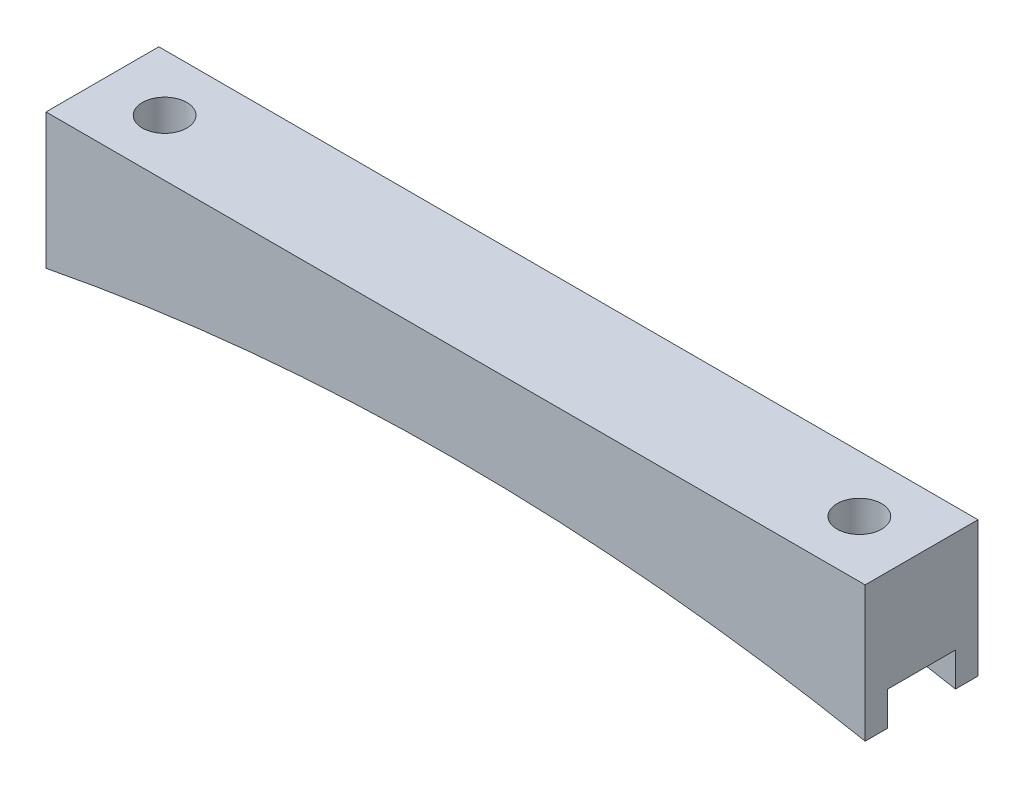
ISO-10303-21;
HEADER;
FILE_DESCRIPTION(('STEP AP214'),'2;1');
FILE_NAME('part.step','',(''),(''),'','','');
FILE_SCHEMA(('AUTOMOTIVE_DESIGN { 1 0 10303 214 1 1 1 1 }'));
ENDSEC;
DATA;
#1=APPLICATION_CONTEXT('core data for automotive mechanical design processes');
#2=APPLICATION_PROTOCOL_DEFINITION('international standard','automotive_design',2000,#1);
#3=PRODUCT_CONTEXT('',#1,'mechanical');
#4=PRODUCT('Part','Part','',(#3));
#5=PRODUCT_RELATED_PRODUCT_CATEGORY('part','',(#4));
#6=PRODUCT_DEFINITION_FORMATION('','',#4);
#7=PRODUCT_DEFINITION_CONTEXT('part definition',#1,'design');
#8=PRODUCT_DEFINITION('design','',#6,#7);
#9=PRODUCT_DEFINITION_SHAPE('','',#8);
#10=(LENGTH_UNIT() NAMED_UNIT(*) SI_UNIT(.MILLI.,.METRE.));
#11=(NAMED_UNIT(*) PLANE_ANGLE_UNIT() SI_UNIT($,.RADIAN.));
#12=(NAMED_UNIT(*) SI_UNIT($,.STERADIAN.) SOLID_ANGLE_UNIT());
#13=UNCERTAINTY_MEASURE_WITH_UNIT(LENGTH_MEASURE(1.E-05),#10,'distance_accuracy_value','');
#14=(GEOMETRIC_REPRESENTATION_CONTEXT(3) GLOBAL_UNCERTAINTY_ASSIGNED_CONTEXT((#13)) GLOBAL_UNIT_ASSIGNED_CONTEXT((#10,
#11,#12)) REPRESENTATION_CONTEXT('',''));
#15=CARTESIAN_POINT('',(0.,0.,0.));
#16=DIRECTION('',(0.,0.,1.));
#17=DIRECTION('',(1.,0.,0.));
#18=AXIS2_PLACEMENT_3D('',#15,#16,#17);
#19=CARTESIAN_POINT('',(46.095,0.,12.7));
#20=DIRECTION('',(-1.,0.,0.));
#21=DIRECTION('',(0.,0.,1.));
#22=AXIS2_PLACEMENT_3D('',#19,#20,#21);
#23=PLANE('',#22);
#24=DIRECTION('',(0.,0.,-1.));
#25=VECTOR('',#24,1.);
#26=CARTESIAN_POINT('',(46.095,-15.24,12.7));
#27=LINE('',#26,#25);
#28=CARTESIAN_POINT('',(46.095,-15.24,12.7));
#29=VERTEX_POINT('',#28);
#30=CARTESIAN_POINT('',(46.095,-15.24,10.16));
#31=VERTEX_POINT('',#30);
#32=EDGE_CURVE('E156',#29,#31,#27,.T.);
#33=ORIENTED_EDGE('',*,*,#32,.T.);
#34=DIRECTION('',(0.,-1.,0.));
#35=VECTOR('',#34,1.);
#36=CARTESIAN_POINT('',(46.095,-15.24,10.16));
#37=LINE('',#36,#35);
#38=CARTESIAN_POINT('',(46.095,-11.43,10.16));
#39=VERTEX_POINT('',#38);
#40=EDGE_CURVE('E185',#39,#31,#37,.T.);
#41=ORIENTED_EDGE('',*,*,#40,.F.);
#42=DIRECTION('',(0.,0.,1.));
#43=VECTOR('',#42,1.);
#44=CARTESIAN_POINT('',(46.095,-11.43,10.16));
#45=LINE('',#44,#43);
#46=CARTESIAN_POINT('',(46.095,-11.43,2.54));
#47=VERTEX_POINT('',#46);
#48=EDGE_CURVE('E141',#47,#39,#45,.T.);
#49=ORIENTED_EDGE('',*,*,#48,.F.);
#50=DIRECTION('',(0.,1.,0.));
#51=VECTOR('',#50,1.);
#52=CARTESIAN_POINT('',(46.095,-15.24,2.54));
#53=LINE('',#52,#51);
#54=CARTESIAN_POINT('',(46.095,-15.24,2.54));
#55=VERTEX_POINT('',#54);
#56=EDGE_CURVE('E177',#55,#47,#53,.T.);
#57=ORIENTED_EDGE('',*,*,#56,.F.);
#58=CARTESIAN_POINT('',(46.095,-15.24,0.));
#59=VERTEX_POINT('',#58);
#60=EDGE_CURVE('E174',#55,#59,#27,.T.);
#61=ORIENTED_EDGE('',*,*,#60,.T.);
#62=DIRECTION('',(0.,1.,0.));
#63=VECTOR('',#62,1.);
#64=CARTESIAN_POINT('',(46.095,0.,0.));
#65=LINE('',#64,#63);
#66=CARTESIAN_POINT('',(46.095,0.,0.));
#67=VERTEX_POINT('',#66);
#68=EDGE_CURVE('E213',#59,#67,#65,.T.);
#69=ORIENTED_EDGE('',*,*,#68,.T.);
#70=DIRECTION('',(0.,0.,-1.));
#71=VECTOR('',#70,1.);
#72=CARTESIAN_POINT('',(46.095,0.,12.7));
#73=LINE('',#72,#71);
#74=CARTESIAN_POINT('',(46.095,0.,12.7));
#75=VERTEX_POINT('',#74);
#76=EDGE_CURVE('E154',#75,#67,#73,.T.);
#77=ORIENTED_EDGE('',*,*,#76,.F.);
#78=DIRECTION('',(0.,1.,0.));
#79=VECTOR('',#78,1.);
#80=CARTESIAN_POINT('',(46.095,0.,12.7));
#81=LINE('',#80,#79);
#82=EDGE_CURVE('E217',#29,#75,#81,.T.);
#83=ORIENTED_EDGE('',*,*,#82,.F.);
#84=EDGE_LOOP('',(#33,#41,#49,#57,#61,#69,#77,#83));
#85=FACE_BOUND('',#84,.T.);
#86=ADVANCED_FACE('F43',(#85),#23,.F.);
#87=CARTESIAN_POINT('',(-46.095,0.,12.7));
#88=DIRECTION('',(0.,-1.,0.));
#89=DIRECTION('',(1.,0.,0.));
#90=AXIS2_PLACEMENT_3D('',#87,#88,#89);
#91=PLANE('',#90);
#92=CARTESIAN_POINT('',(-39.095,0.,6.35));
#93=DIRECTION('',(0.,1.,0.));
#94=DIRECTION('',(-1.,0.,0.));
#95=AXIS2_PLACEMENT_3D('',#92,#93,#94);
#96=CIRCLE('',#95,2.49999999999999);
#97=CARTESIAN_POINT('',(-41.595,0.,6.35));
#98=VERTEX_POINT('',#97);
#99=EDGE_CURVE('E209',#98,#98,#96,.T.);
#100=ORIENTED_EDGE('',*,*,#99,.F.);
#101=EDGE_LOOP('',(#100));
#102=FACE_BOUND('',#101,.T.);
#103=CARTESIAN_POINT('',(39.095,0.,6.35));
#104=DIRECTION('',(0.,1.,0.));
#105=DIRECTION('',(-1.,0.,0.));
#106=AXIS2_PLACEMENT_3D('',#103,#104,#105);
#107=CIRCLE('',#106,2.5);
#108=CARTESIAN_POINT('',(36.595,0.,6.35));
#109=VERTEX_POINT('',#108);
#110=EDGE_CURVE('E208',#109,#109,#107,.T.);
#111=ORIENTED_EDGE('',*,*,#110,.F.);
#112=EDGE_LOOP('',(#111));
#113=FACE_BOUND('',#112,.T.);
#114=DIRECTION('',(-1.,0.,0.));
#115=VECTOR('',#114,1.);
#116=CARTESIAN_POINT('',(-46.095,0.,0.));
#117=LINE('',#116,#115);
#118=CARTESIAN_POINT('',(-46.095,0.,0.));
#119=VERTEX_POINT('',#118);
#120=EDGE_CURVE('E232',#67,#119,#117,.T.);
#121=ORIENTED_EDGE('',*,*,#120,.T.);
#122=DIRECTION('',(0.,0.,-1.));
#123=VECTOR('',#122,1.);
#124=CARTESIAN_POINT('',(-46.095,0.,12.7));
#125=LINE('',#124,#123);
#126=CARTESIAN_POINT('',(-46.095,0.,12.7));
#127=VERTEX_POINT('',#126);
#128=EDGE_CURVE('E148',#127,#119,#125,.T.);
#129=ORIENTED_EDGE('',*,*,#128,.F.);
#130=DIRECTION('',(-1.,0.,0.));
#131=VECTOR('',#130,1.);
#132=CARTESIAN_POINT('',(-46.095,0.,12.7));
#133=LINE('',#132,#131);
#134=EDGE_CURVE('E221',#75,#127,#133,.T.);
#135=ORIENTED_EDGE('',*,*,#134,.F.);
#136=ORIENTED_EDGE('',*,*,#76,.T.);
#137=EDGE_LOOP('',(#121,#129,#135,#136));
#138=FACE_BOUND('',#137,.T.);
#139=ADVANCED_FACE('F247',(#102,#113,#138),#91,.F.);
#140=CARTESIAN_POINT('',(-46.095,0.,12.7));
#141=DIRECTION('',(1.,0.,0.));
#142=DIRECTION('',(0.,0.,-1.));
#143=AXIS2_PLACEMENT_3D('',#140,#141,#142);
#144=PLANE('',#143);
#145=DIRECTION('',(0.,0.,1.));
#146=VECTOR('',#145,1.);
#147=CARTESIAN_POINT('',(-46.095,-11.43,10.16));
#148=LINE('',#147,#146);
#149=CARTESIAN_POINT('',(-46.095,-11.43,2.54));
#150=VERTEX_POINT('',#149);
#151=CARTESIAN_POINT('',(-46.095,-11.43,10.16));
#152=VERTEX_POINT('',#151);
#153=EDGE_CURVE('E139',#150,#152,#148,.T.);
#154=ORIENTED_EDGE('',*,*,#153,.T.);
#155=DIRECTION('',(0.,-1.,0.));
#156=VECTOR('',#155,1.);
#157=CARTESIAN_POINT('',(-46.095,-15.24,10.16));
#158=LINE('',#157,#156);
#159=CARTESIAN_POINT('',(-46.095,-15.24,10.16));
#160=VERTEX_POINT('',#159);
#161=EDGE_CURVE('E124',#152,#160,#158,.T.);
#162=ORIENTED_EDGE('',*,*,#161,.T.);
#163=DIRECTION('',(0.,0.,-1.));
#164=VECTOR('',#163,1.);
#165=CARTESIAN_POINT('',(-46.095,-15.24,12.7));
#166=LINE('',#165,#164);
#167=CARTESIAN_POINT('',(-46.095,-15.24,12.7));
#168=VERTEX_POINT('',#167);
#169=EDGE_CURVE('E136',#168,#160,#166,.T.);
#170=ORIENTED_EDGE('',*,*,#169,.F.);
#171=DIRECTION('',(0.,-1.,0.));
#172=VECTOR('',#171,1.);
#173=CARTESIAN_POINT('',(-46.095,0.,12.7));
#174=LINE('',#173,#172);
#175=EDGE_CURVE('E225',#127,#168,#174,.T.);
#176=ORIENTED_EDGE('',*,*,#175,.F.);
#177=ORIENTED_EDGE('',*,*,#128,.T.);
#178=DIRECTION('',(0.,-1.,0.));
#179=VECTOR('',#178,1.);
#180=CARTESIAN_POINT('',(-46.095,0.,0.));
#181=LINE('',#180,#179);
#182=CARTESIAN_POINT('',(-46.095,-15.24,0.));
#183=VERTEX_POINT('',#182);
#184=EDGE_CURVE('E235',#119,#183,#181,.T.);
#185=ORIENTED_EDGE('',*,*,#184,.T.);
#186=CARTESIAN_POINT('',(-46.095,-15.24,2.54));
#187=VERTEX_POINT('',#186);
#188=EDGE_CURVE('E149',#187,#183,#166,.T.);
#189=ORIENTED_EDGE('',*,*,#188,.F.);
#190=DIRECTION('',(0.,1.,0.));
#191=VECTOR('',#190,1.);
#192=CARTESIAN_POINT('',(-46.095,-15.24,2.54));
#193=LINE('',#192,#191);
#194=EDGE_CURVE('E67',#187,#150,#193,.T.);
#195=ORIENTED_EDGE('',*,*,#194,.T.);
#196=EDGE_LOOP('',(#154,#162,#170,#176,#177,#185,#189,#195));
#197=FACE_BOUND('',#196,.T.);
#198=ADVANCED_FACE('F134',(#197),#144,.F.);
#199=CARTESIAN_POINT('',(0.,-252.096372037993,12.7));
#200=DIRECTION('',(0.,0.,-1.));
#201=DIRECTION('',(-1.,0.,0.));
#202=AXIS2_PLACEMENT_3D('',#199,#200,#201);
#203=CYLINDRICAL_SURFACE('',#202,241.3);
#204=DIRECTION('',(0.,0.,-1.));
#205=VECTOR('',#204,1.);
#206=CARTESIAN_POINT('',(17.4753360502879,-11.43,12.7));
#207=LINE('',#206,#205);
#208=CARTESIAN_POINT('',(17.4753360502879,-11.43,2.54));
#209=VERTEX_POINT('',#208);
#210=CARTESIAN_POINT('',(17.4753360502879,-11.43,10.16));
#211=VERTEX_POINT('',#210);
#212=EDGE_CURVE('E172',#209,#211,#207,.F.);
#213=ORIENTED_EDGE('',*,*,#212,.T.);
#214=CARTESIAN_POINT('',(0.,-252.096372037993,10.16));
#215=DIRECTION('',(0.,0.,1.));
#216=DIRECTION('',(1.,0.,0.));
#217=AXIS2_PLACEMENT_3D('',#214,#215,#216);
#218=CIRCLE('',#217,241.3);
#219=EDGE_CURVE('E11',#211,#31,#218,.F.);
#220=ORIENTED_EDGE('',*,*,#219,.T.);
#221=ORIENTED_EDGE('',*,*,#32,.F.);
#222=CARTESIAN_POINT('',(0.,-252.096372037993,12.7));
#223=DIRECTION('',(0.,0.,-1.));
#224=DIRECTION('',(-1.,0.,0.));
#225=AXIS2_PLACEMENT_3D('',#222,#223,#224);
#226=CIRCLE('',#225,241.3);
#227=EDGE_CURVE('E146',#168,#29,#226,.T.);
#228=ORIENTED_EDGE('',*,*,#227,.F.);
#229=ORIENTED_EDGE('',*,*,#169,.T.);
#230=CARTESIAN_POINT('',(-17.4753360502879,-11.43,10.16));
#231=VERTEX_POINT('',#230);
#232=EDGE_CURVE('E46',#160,#231,#218,.F.);
#233=ORIENTED_EDGE('',*,*,#232,.T.);
#234=DIRECTION('',(0.,0.,-1.));
#235=VECTOR('',#234,1.);
#236=CARTESIAN_POINT('',(-17.4753360502879,-11.43,12.7));
#237=LINE('',#236,#235);
#238=CARTESIAN_POINT('',(-17.4753360502879,-11.43,2.54));
#239=VERTEX_POINT('',#238);
#240=EDGE_CURVE('E203',#231,#239,#237,.T.);
#241=ORIENTED_EDGE('',*,*,#240,.T.);
#242=CARTESIAN_POINT('',(0.,-252.096372037993,2.54));
#243=DIRECTION('',(0.,0.,-1.));
#244=DIRECTION('',(-1.,0.,0.));
#245=AXIS2_PLACEMENT_3D('',#242,#243,#244);
#246=CIRCLE('',#245,241.3);
#247=EDGE_CURVE('E131',#239,#187,#246,.F.);
#248=ORIENTED_EDGE('',*,*,#247,.T.);
#249=ORIENTED_EDGE('',*,*,#188,.T.);
#250=CARTESIAN_POINT('',(0.,-252.096372037993,0.));
#251=DIRECTION('',(0.,0.,-1.));
#252=DIRECTION('',(-1.,0.,0.));
#253=AXIS2_PLACEMENT_3D('',#250,#251,#252);
#254=CIRCLE('',#253,241.3);
#255=EDGE_CURVE('E222',#183,#59,#254,.T.);
#256=ORIENTED_EDGE('',*,*,#255,.T.);
#257=ORIENTED_EDGE('',*,*,#60,.F.);
#258=EDGE_CURVE('E52',#55,#209,#246,.F.);
#259=ORIENTED_EDGE('',*,*,#258,.T.);
#260=EDGE_LOOP('',(#213,#220,#221,#228,#229,#233,#241,#248,#249,#256,#257,#259));
#261=FACE_BOUND('',#260,.T.);
#262=ADVANCED_FACE('F144',(#261),#203,.F.);
#263=CARTESIAN_POINT('',(0.,-252.096372037993,12.7));
#264=DIRECTION('',(0.,0.,-1.));
#265=DIRECTION('',(-1.,0.,0.));
#266=AXIS2_PLACEMENT_3D('',#263,#264,#265);
#267=PLANE('',#266);
#268=ORIENTED_EDGE('',*,*,#82,.T.);
#269=ORIENTED_EDGE('',*,*,#134,.T.);
#270=ORIENTED_EDGE('',*,*,#175,.T.);
#271=ORIENTED_EDGE('',*,*,#227,.T.);
#272=EDGE_LOOP('',(#268,#269,#270,#271));
#273=FACE_BOUND('',#272,.T.);
#274=ADVANCED_FACE('F250',(#273),#267,.F.);
#275=CARTESIAN_POINT('',(0.,-252.096372037993,0.));
#276=DIRECTION('',(0.,0.,-1.));
#277=DIRECTION('',(-1.,0.,0.));
#278=AXIS2_PLACEMENT_3D('',#275,#276,#277);
#279=PLANE('',#278);
#280=ORIENTED_EDGE('',*,*,#68,.F.);
#281=ORIENTED_EDGE('',*,*,#255,.F.);
#282=ORIENTED_EDGE('',*,*,#184,.F.);
#283=ORIENTED_EDGE('',*,*,#120,.F.);
#284=EDGE_LOOP('',(#280,#281,#282,#283));
#285=FACE_BOUND('',#284,.T.);
#286=ADVANCED_FACE('F243',(#285),#279,.T.);
#287=CARTESIAN_POINT('',(39.095,-15.24,6.35));
#288=DIRECTION('',(0.,1.,0.));
#289=DIRECTION('',(-1.,0.,0.));
#290=AXIS2_PLACEMENT_3D('',#287,#288,#289);
#291=CYLINDRICAL_SURFACE('',#290,2.5);
#292=CARTESIAN_POINT('',(39.095,-11.43,6.35));
#293=DIRECTION('',(0.,1.,0.));
#294=DIRECTION('',(0.,0.,1.));
#295=AXIS2_PLACEMENT_3D('',#292,#293,#294);
#296=CIRCLE('',#295,2.5);
#297=CARTESIAN_POINT('',(39.095,-11.43,8.85));
#298=VERTEX_POINT('',#297);
#299=EDGE_CURVE('E166',#298,#298,#296,.F.);
#300=ORIENTED_EDGE('',*,*,#299,.T.);
#301=EDGE_LOOP('',(#300));
#302=FACE_BOUND('',#301,.T.);
#303=ORIENTED_EDGE('',*,*,#110,.T.);
#304=EDGE_LOOP('',(#303));
#305=FACE_BOUND('',#304,.T.);
#306=ADVANCED_FACE('F292',(#302,#305),#291,.F.);
#307=CARTESIAN_POINT('',(-39.095,-15.24,6.35));
#308=DIRECTION('',(0.,1.,0.));
#309=DIRECTION('',(-1.,0.,0.));
#310=AXIS2_PLACEMENT_3D('',#307,#308,#309);
#311=CYLINDRICAL_SURFACE('',#310,2.49999999999999);
#312=CARTESIAN_POINT('',(-39.095,-11.43,6.35));
#313=DIRECTION('',(0.,1.,0.));
#314=DIRECTION('',(0.,0.,1.));
#315=AXIS2_PLACEMENT_3D('',#312,#313,#314);
#316=CIRCLE('',#315,2.49999999999999);
#317=CARTESIAN_POINT('',(-39.095,-11.43,8.84999999999999));
#318=VERTEX_POINT('',#317);
#319=EDGE_CURVE('E163',#318,#318,#316,.F.);
#320=ORIENTED_EDGE('',*,*,#319,.T.);
#321=EDGE_LOOP('',(#320));
#322=FACE_BOUND('',#321,.T.);
#323=ORIENTED_EDGE('',*,*,#99,.T.);
#324=EDGE_LOOP('',(#323));
#325=FACE_BOUND('',#324,.T.);
#326=ADVANCED_FACE('F274',(#322,#325),#311,.F.);
#327=CARTESIAN_POINT('',(-46.095,-11.43,10.16));
#328=DIRECTION('',(0.,1.,0.));
#329=DIRECTION('',(0.,0.,1.));
#330=AXIS2_PLACEMENT_3D('',#327,#328,#329);
#331=PLANE('',#330);
#332=ORIENTED_EDGE('',*,*,#319,.F.);
#333=EDGE_LOOP('',(#332));
#334=FACE_BOUND('',#333,.T.);
#335=DIRECTION('',(1.,0.,0.));
#336=VECTOR('',#335,1.);
#337=CARTESIAN_POINT('',(-46.095,-11.43,10.16));
#338=LINE('',#337,#336);
#339=EDGE_CURVE('E126',#152,#231,#338,.T.);
#340=ORIENTED_EDGE('',*,*,#339,.F.);
#341=ORIENTED_EDGE('',*,*,#153,.F.);
#342=DIRECTION('',(1.,0.,0.));
#343=VECTOR('',#342,1.);
#344=CARTESIAN_POINT('',(-46.095,-11.43,2.54));
#345=LINE('',#344,#343);
#346=EDGE_CURVE('E196',#150,#239,#345,.T.);
#347=ORIENTED_EDGE('',*,*,#346,.T.);
#348=ORIENTED_EDGE('',*,*,#240,.F.);
#349=EDGE_LOOP('',(#340,#341,#347,#348));
#350=FACE_BOUND('',#349,.T.);
#351=ADVANCED_FACE('F266',(#334,#350),#331,.F.);
#352=CARTESIAN_POINT('',(-46.095,-15.24,2.54));
#353=DIRECTION('',(0.,0.,-1.));
#354=DIRECTION('',(-1.,0.,0.));
#355=AXIS2_PLACEMENT_3D('',#352,#353,#354);
#356=PLANE('',#355);
#357=ORIENTED_EDGE('',*,*,#346,.F.);
#358=ORIENTED_EDGE('',*,*,#194,.F.);
#359=ORIENTED_EDGE('',*,*,#247,.F.);
#360=EDGE_LOOP('',(#357,#358,#359));
#361=FACE_BOUND('',#360,.T.);
#362=ADVANCED_FACE('F271',(#361),#356,.F.);
#363=CARTESIAN_POINT('',(-46.095,-15.24,10.16));
#364=DIRECTION('',(0.,0.,1.));
#365=DIRECTION('',(1.,0.,0.));
#366=AXIS2_PLACEMENT_3D('',#363,#364,#365);
#367=PLANE('',#366);
#368=ORIENTED_EDGE('',*,*,#161,.F.);
#369=ORIENTED_EDGE('',*,*,#339,.T.);
#370=ORIENTED_EDGE('',*,*,#232,.F.);
#371=EDGE_LOOP('',(#368,#369,#370));
#372=FACE_BOUND('',#371,.T.);
#373=ADVANCED_FACE('F123',(#372),#367,.F.);
#374=EDGE_CURVE('E195',#211,#39,#338,.T.);
#375=ORIENTED_EDGE('',*,*,#374,.T.);
#376=ORIENTED_EDGE('',*,*,#40,.T.);
#377=ORIENTED_EDGE('',*,*,#219,.F.);
#378=EDGE_LOOP('',(#375,#376,#377));
#379=FACE_BOUND('',#378,.T.);
#380=ADVANCED_FACE('F254',(#379),#367,.F.);
#381=ORIENTED_EDGE('',*,*,#56,.T.);
#382=EDGE_CURVE('E59',#209,#47,#345,.T.);
#383=ORIENTED_EDGE('',*,*,#382,.F.);
#384=ORIENTED_EDGE('',*,*,#258,.F.);
#385=EDGE_LOOP('',(#381,#383,#384));
#386=FACE_BOUND('',#385,.T.);
#387=ADVANCED_FACE('F176',(#386),#356,.F.);
#388=ORIENTED_EDGE('',*,*,#299,.F.);
#389=EDGE_LOOP('',(#388));
#390=FACE_BOUND('',#389,.T.);
#391=ORIENTED_EDGE('',*,*,#382,.T.);
#392=ORIENTED_EDGE('',*,*,#48,.T.);
#393=ORIENTED_EDGE('',*,*,#374,.F.);
#394=ORIENTED_EDGE('',*,*,#212,.F.);
#395=EDGE_LOOP('',(#391,#392,#393,#394));
#396=FACE_BOUND('',#395,.T.);
#397=ADVANCED_FACE('F258',(#390,#396),#331,.F.);
#398=CLOSED_SHELL('',(#86,#139,#198,#262,#274,#286,#306,#326,#351,#362,#373,#380,#387,#397));
#399=MANIFOLD_SOLID_BREP('B2',#398);
#400=ADVANCED_BREP_SHAPE_REPRESENTATION('',(#18,#399),#14);
#401=SHAPE_DEFINITION_REPRESENTATION(#9,#400);
ENDSEC;
END-ISO-10303-21;
